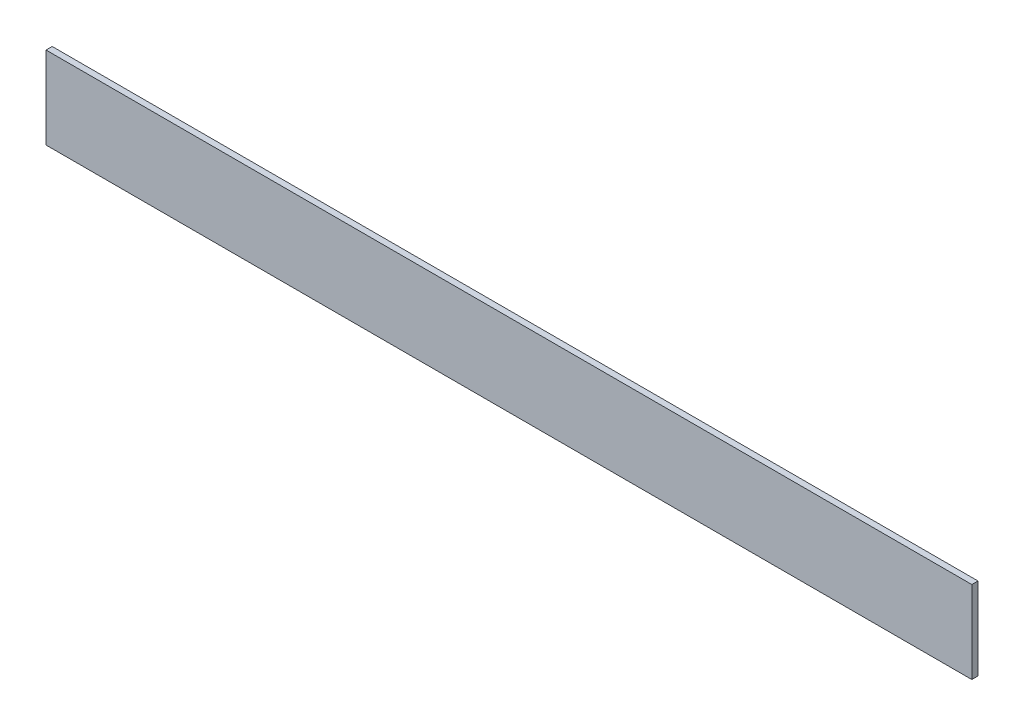
ISO-10303-21;
HEADER;
FILE_DESCRIPTION(('STEP AP214'),'2;1');
FILE_NAME('part.step','',(''),(''),'','','');
FILE_SCHEMA(('AUTOMOTIVE_DESIGN { 1 0 10303 214 1 1 1 1 }'));
ENDSEC;
DATA;
#1=APPLICATION_CONTEXT('core data for automotive mechanical design processes');
#2=APPLICATION_PROTOCOL_DEFINITION('international standard','automotive_design',2000,#1);
#3=PRODUCT_CONTEXT('',#1,'mechanical');
#4=PRODUCT('Part','Part','',(#3));
#5=PRODUCT_RELATED_PRODUCT_CATEGORY('part','',(#4));
#6=PRODUCT_DEFINITION_FORMATION('','',#4);
#7=PRODUCT_DEFINITION_CONTEXT('part definition',#1,'design');
#8=PRODUCT_DEFINITION('design','',#6,#7);
#9=PRODUCT_DEFINITION_SHAPE('','',#8);
#10=(LENGTH_UNIT() NAMED_UNIT(*) SI_UNIT(.MILLI.,.METRE.));
#11=(NAMED_UNIT(*) PLANE_ANGLE_UNIT() SI_UNIT($,.RADIAN.));
#12=(NAMED_UNIT(*) SI_UNIT($,.STERADIAN.) SOLID_ANGLE_UNIT());
#13=UNCERTAINTY_MEASURE_WITH_UNIT(LENGTH_MEASURE(1.E-05),#10,'distance_accuracy_value','');
#14=(GEOMETRIC_REPRESENTATION_CONTEXT(3) GLOBAL_UNCERTAINTY_ASSIGNED_CONTEXT((#13)) GLOBAL_UNIT_ASSIGNED_CONTEXT((#10,
#11,#12)) REPRESENTATION_CONTEXT('',''));
#15=CARTESIAN_POINT('',(0.,0.,0.));
#16=DIRECTION('',(0.,0.,1.));
#17=DIRECTION('',(1.,0.,0.));
#18=AXIS2_PLACEMENT_3D('',#15,#16,#17);
#19=CARTESIAN_POINT('',(-141.915548672909,80.2254823952727,3.));
#20=DIRECTION('',(1.,0.,0.));
#21=DIRECTION('',(0.,0.,-1.));
#22=AXIS2_PLACEMENT_3D('',#19,#20,#21);
#23=PLANE('',#22);
#24=DIRECTION('',(0.,-1.,0.));
#25=VECTOR('',#24,1.);
#26=CARTESIAN_POINT('',(-141.915548672909,80.2254823952727,0.));
#27=LINE('',#26,#25);
#28=CARTESIAN_POINT('',(-141.915548672909,80.2254823952727,0.));
#29=VERTEX_POINT('',#28);
#30=CARTESIAN_POINT('',(-141.915548672909,40.2254823952727,0.));
#31=VERTEX_POINT('',#30);
#32=EDGE_CURVE('E113',#29,#31,#27,.T.);
#33=ORIENTED_EDGE('',*,*,#32,.T.);
#34=DIRECTION('',(0.,0.,-1.));
#35=VECTOR('',#34,1.);
#36=CARTESIAN_POINT('',(-141.915548672909,40.2254823952727,3.));
#37=LINE('',#36,#35);
#38=CARTESIAN_POINT('',(-141.915548672909,40.2254823952727,3.));
#39=VERTEX_POINT('',#38);
#40=EDGE_CURVE('E11',#39,#31,#37,.T.);
#41=ORIENTED_EDGE('',*,*,#40,.F.);
#42=DIRECTION('',(0.,-1.,0.));
#43=VECTOR('',#42,1.);
#44=CARTESIAN_POINT('',(-141.915548672909,80.2254823952727,3.));
#45=LINE('',#44,#43);
#46=CARTESIAN_POINT('',(-141.915548672909,80.2254823952727,3.));
#47=VERTEX_POINT('',#46);
#48=EDGE_CURVE('E97',#47,#39,#45,.T.);
#49=ORIENTED_EDGE('',*,*,#48,.F.);
#50=DIRECTION('',(0.,0.,-1.));
#51=VECTOR('',#50,1.);
#52=CARTESIAN_POINT('',(-141.915548672909,80.2254823952727,3.));
#53=LINE('',#52,#51);
#54=EDGE_CURVE('E109',#47,#29,#53,.T.);
#55=ORIENTED_EDGE('',*,*,#54,.T.);
#56=EDGE_LOOP('',(#33,#41,#49,#55));
#57=FACE_BOUND('',#56,.T.);
#58=ADVANCED_FACE('F45',(#57),#23,.F.);
#59=CARTESIAN_POINT('',(-141.915548672909,40.2254823952727,3.));
#60=DIRECTION('',(0.,1.,0.));
#61=DIRECTION('',(0.,0.,1.));
#62=AXIS2_PLACEMENT_3D('',#59,#60,#61);
#63=PLANE('',#62);
#64=DIRECTION('',(1.,0.,0.));
#65=VECTOR('',#64,1.);
#66=CARTESIAN_POINT('',(-141.915548672909,40.2254823952727,0.));
#67=LINE('',#66,#65);
#68=CARTESIAN_POINT('',(308.084451327091,40.2254823952727,0.));
#69=VERTEX_POINT('',#68);
#70=EDGE_CURVE('E102',#31,#69,#67,.T.);
#71=ORIENTED_EDGE('',*,*,#70,.T.);
#72=DIRECTION('',(0.,0.,-1.));
#73=VECTOR('',#72,1.);
#74=CARTESIAN_POINT('',(308.084451327091,40.2254823952727,3.));
#75=LINE('',#74,#73);
#76=CARTESIAN_POINT('',(308.084451327091,40.2254823952727,3.));
#77=VERTEX_POINT('',#76);
#78=EDGE_CURVE('E54',#77,#69,#75,.T.);
#79=ORIENTED_EDGE('',*,*,#78,.F.);
#80=DIRECTION('',(1.,0.,0.));
#81=VECTOR('',#80,1.);
#82=CARTESIAN_POINT('',(-141.915548672909,40.2254823952727,3.));
#83=LINE('',#82,#81);
#84=EDGE_CURVE('E92',#39,#77,#83,.T.);
#85=ORIENTED_EDGE('',*,*,#84,.F.);
#86=ORIENTED_EDGE('',*,*,#40,.T.);
#87=EDGE_LOOP('',(#71,#79,#85,#86));
#88=FACE_BOUND('',#87,.T.);
#89=ADVANCED_FACE('F101',(#88),#63,.F.);
#90=CARTESIAN_POINT('',(308.084451327091,80.2254823952727,3.));
#91=DIRECTION('',(-1.,0.,0.));
#92=DIRECTION('',(0.,0.,1.));
#93=AXIS2_PLACEMENT_3D('',#90,#91,#92);
#94=PLANE('',#93);
#95=DIRECTION('',(0.,1.,0.));
#96=VECTOR('',#95,1.);
#97=CARTESIAN_POINT('',(308.084451327091,80.2254823952727,0.));
#98=LINE('',#97,#96);
#99=CARTESIAN_POINT('',(308.084451327091,80.2254823952727,0.));
#100=VERTEX_POINT('',#99);
#101=EDGE_CURVE('E79',#69,#100,#98,.T.);
#102=ORIENTED_EDGE('',*,*,#101,.T.);
#103=DIRECTION('',(0.,0.,-1.));
#104=VECTOR('',#103,1.);
#105=CARTESIAN_POINT('',(308.084451327091,80.2254823952727,3.));
#106=LINE('',#105,#104);
#107=CARTESIAN_POINT('',(308.084451327091,80.2254823952727,3.));
#108=VERTEX_POINT('',#107);
#109=EDGE_CURVE('E104',#108,#100,#106,.T.);
#110=ORIENTED_EDGE('',*,*,#109,.F.);
#111=DIRECTION('',(0.,1.,0.));
#112=VECTOR('',#111,1.);
#113=CARTESIAN_POINT('',(308.084451327091,80.2254823952727,3.));
#114=LINE('',#113,#112);
#115=EDGE_CURVE('E95',#77,#108,#114,.T.);
#116=ORIENTED_EDGE('',*,*,#115,.F.);
#117=ORIENTED_EDGE('',*,*,#78,.T.);
#118=EDGE_LOOP('',(#102,#110,#116,#117));
#119=FACE_BOUND('',#118,.T.);
#120=ADVANCED_FACE('F105',(#119),#94,.F.);
#121=CARTESIAN_POINT('',(-141.915548672909,80.2254823952727,3.));
#122=DIRECTION('',(0.,-1.,0.));
#123=DIRECTION('',(0.,0.,-1.));
#124=AXIS2_PLACEMENT_3D('',#121,#122,#123);
#125=PLANE('',#124);
#126=DIRECTION('',(-1.,0.,0.));
#127=VECTOR('',#126,1.);
#128=CARTESIAN_POINT('',(-141.915548672909,80.2254823952727,0.));
#129=LINE('',#128,#127);
#130=EDGE_CURVE('E85',#100,#29,#129,.T.);
#131=ORIENTED_EDGE('',*,*,#130,.T.);
#132=ORIENTED_EDGE('',*,*,#54,.F.);
#133=DIRECTION('',(-1.,0.,0.));
#134=VECTOR('',#133,1.);
#135=CARTESIAN_POINT('',(-141.915548672909,80.2254823952727,3.));
#136=LINE('',#135,#134);
#137=EDGE_CURVE('E62',#108,#47,#136,.T.);
#138=ORIENTED_EDGE('',*,*,#137,.F.);
#139=ORIENTED_EDGE('',*,*,#109,.T.);
#140=EDGE_LOOP('',(#131,#132,#138,#139));
#141=FACE_BOUND('',#140,.T.);
#142=ADVANCED_FACE('F126',(#141),#125,.F.);
#143=CARTESIAN_POINT('',(0.,0.,3.));
#144=DIRECTION('',(0.,0.,1.));
#145=DIRECTION('',(1.,0.,0.));
#146=AXIS2_PLACEMENT_3D('',#143,#144,#145);
#147=PLANE('',#146);
#148=ORIENTED_EDGE('',*,*,#48,.T.);
#149=ORIENTED_EDGE('',*,*,#84,.T.);
#150=ORIENTED_EDGE('',*,*,#115,.T.);
#151=ORIENTED_EDGE('',*,*,#137,.T.);
#152=EDGE_LOOP('',(#148,#149,#150,#151));
#153=FACE_BOUND('',#152,.T.);
#154=ADVANCED_FACE('F93',(#153),#147,.T.);
#155=CARTESIAN_POINT('',(0.,0.,0.));
#156=DIRECTION('',(0.,0.,1.));
#157=DIRECTION('',(1.,0.,0.));
#158=AXIS2_PLACEMENT_3D('',#155,#156,#157);
#159=PLANE('',#158);
#160=ORIENTED_EDGE('',*,*,#32,.F.);
#161=ORIENTED_EDGE('',*,*,#130,.F.);
#162=ORIENTED_EDGE('',*,*,#101,.F.);
#163=ORIENTED_EDGE('',*,*,#70,.F.);
#164=EDGE_LOOP('',(#160,#161,#162,#163));
#165=FACE_BOUND('',#164,.T.);
#166=ADVANCED_FACE('F129',(#165),#159,.F.);
#167=CLOSED_SHELL('',(#58,#89,#120,#142,#154,#166));
#168=MANIFOLD_SOLID_BREP('B2',#167);
#169=ADVANCED_BREP_SHAPE_REPRESENTATION('',(#18,#168),#14);
#170=SHAPE_DEFINITION_REPRESENTATION(#9,#169);
ENDSEC;
END-ISO-10303-21;
